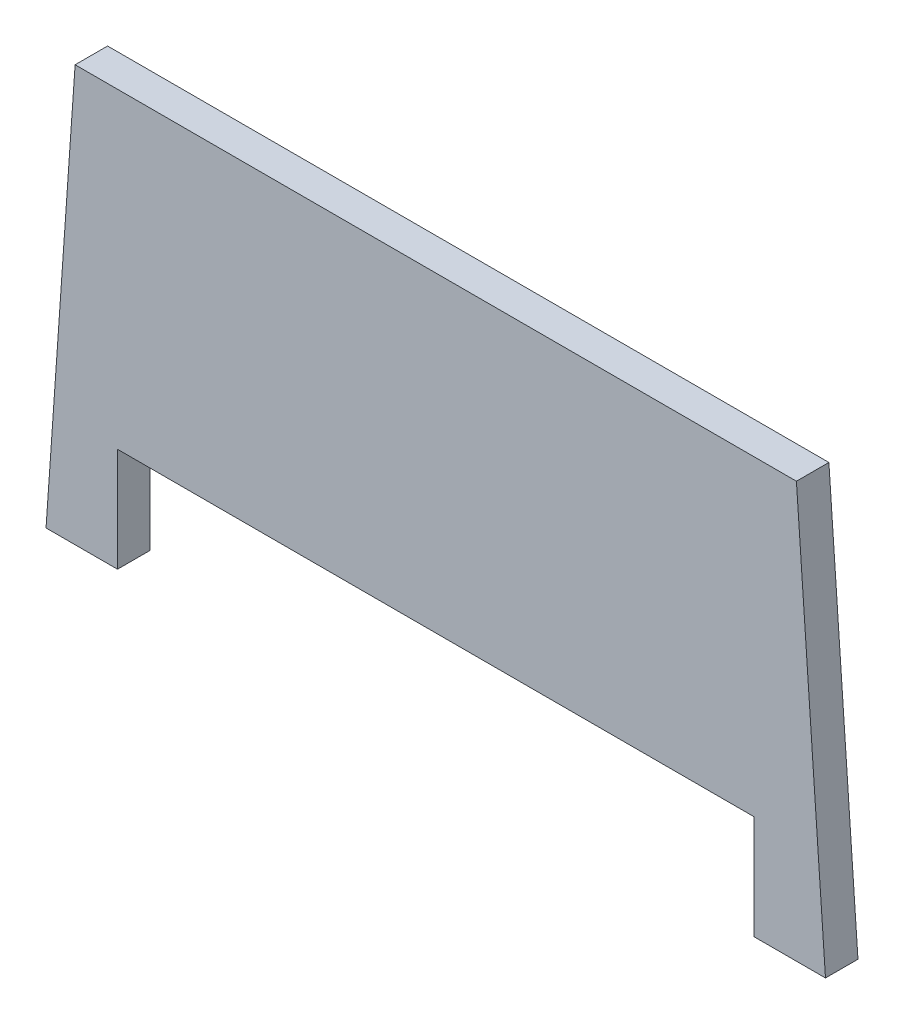
ISO-10303-21;
HEADER;
FILE_DESCRIPTION(('STEP AP214'),'2;1');
FILE_NAME('part.step','',(''),(''),'','','');
FILE_SCHEMA(('AUTOMOTIVE_DESIGN { 1 0 10303 214 1 1 1 1 }'));
ENDSEC;
DATA;
#1=APPLICATION_CONTEXT('core data for automotive mechanical design processes');
#2=APPLICATION_PROTOCOL_DEFINITION('international standard','automotive_design',2000,#1);
#3=PRODUCT_CONTEXT('',#1,'mechanical');
#4=PRODUCT('Part','Part','',(#3));
#5=PRODUCT_RELATED_PRODUCT_CATEGORY('part','',(#4));
#6=PRODUCT_DEFINITION_FORMATION('','',#4);
#7=PRODUCT_DEFINITION_CONTEXT('part definition',#1,'design');
#8=PRODUCT_DEFINITION('design','',#6,#7);
#9=PRODUCT_DEFINITION_SHAPE('','',#8);
#10=(LENGTH_UNIT() NAMED_UNIT(*) SI_UNIT(.MILLI.,.METRE.));
#11=(NAMED_UNIT(*) PLANE_ANGLE_UNIT() SI_UNIT($,.RADIAN.));
#12=(NAMED_UNIT(*) SI_UNIT($,.STERADIAN.) SOLID_ANGLE_UNIT());
#13=UNCERTAINTY_MEASURE_WITH_UNIT(LENGTH_MEASURE(1.E-05),#10,'distance_accuracy_value','');
#14=(GEOMETRIC_REPRESENTATION_CONTEXT(3) GLOBAL_UNCERTAINTY_ASSIGNED_CONTEXT((#13)) GLOBAL_UNIT_ASSIGNED_CONTEXT((#10,
#11,#12)) REPRESENTATION_CONTEXT('',''));
#15=CARTESIAN_POINT('',(0.,0.,0.));
#16=DIRECTION('',(0.,0.,1.));
#17=DIRECTION('',(1.,0.,0.));
#18=AXIS2_PLACEMENT_3D('',#15,#16,#17);
#19=CARTESIAN_POINT('',(627.623420178076,320.,25.));
#20=DIRECTION('',(0.,-1.,0.));
#21=DIRECTION('',(0.,0.,-1.));
#22=AXIS2_PLACEMENT_3D('',#19,#20,#21);
#23=PLANE('',#22);
#24=DIRECTION('',(-1.,0.,0.));
#25=VECTOR('',#24,1.);
#26=CARTESIAN_POINT('',(627.623420178076,320.,0.));
#27=LINE('',#26,#25);
#28=CARTESIAN_POINT('',(627.623420178076,320.,0.));
#29=VERTEX_POINT('',#28);
#30=CARTESIAN_POINT('',(72.3765798219226,320.,0.));
#31=VERTEX_POINT('',#30);
#32=EDGE_CURVE('E109',#29,#31,#27,.T.);
#33=ORIENTED_EDGE('',*,*,#32,.T.);
#34=DIRECTION('',(0.,0.,-1.));
#35=VECTOR('',#34,1.);
#36=CARTESIAN_POINT('',(72.3765798219226,320.,25.));
#37=LINE('',#36,#35);
#38=CARTESIAN_POINT('',(72.3765798219226,320.,25.));
#39=VERTEX_POINT('',#38);
#40=EDGE_CURVE('E11',#39,#31,#37,.T.);
#41=ORIENTED_EDGE('',*,*,#40,.F.);
#42=DIRECTION('',(-1.,0.,0.));
#43=VECTOR('',#42,1.);
#44=CARTESIAN_POINT('',(627.623420178076,320.,25.));
#45=LINE('',#44,#43);
#46=CARTESIAN_POINT('',(627.623420178076,320.,25.));
#47=VERTEX_POINT('',#46);
#48=EDGE_CURVE('E129',#47,#39,#45,.T.);
#49=ORIENTED_EDGE('',*,*,#48,.F.);
#50=DIRECTION('',(0.,0.,-1.));
#51=VECTOR('',#50,1.);
#52=CARTESIAN_POINT('',(627.623420178076,320.,25.));
#53=LINE('',#52,#51);
#54=EDGE_CURVE('E130',#47,#29,#53,.T.);
#55=ORIENTED_EDGE('',*,*,#54,.T.);
#56=EDGE_LOOP('',(#33,#41,#49,#55));
#57=FACE_BOUND('',#56,.T.);
#58=ADVANCED_FACE('F36',(#57),#23,.F.);
#59=CARTESIAN_POINT('',(50.,0.,25.));
#60=DIRECTION('',(-0.997564050259824,0.0697564737441229,0.));
#61=DIRECTION('',(-0.0697564737441229,-0.997564050259825,0.));
#62=AXIS2_PLACEMENT_3D('',#59,#60,#61);
#63=PLANE('',#62);
#64=DIRECTION('',(0.0697564737441229,0.997564050259824,0.));
#65=VECTOR('',#64,1.);
#66=CARTESIAN_POINT('',(50.,0.,0.));
#67=LINE('',#66,#65);
#68=CARTESIAN_POINT('',(50.,0.,0.));
#69=VERTEX_POINT('',#68);
#70=EDGE_CURVE('E119',#69,#31,#67,.T.);
#71=ORIENTED_EDGE('',*,*,#70,.F.);
#72=DIRECTION('',(0.,0.,-1.));
#73=VECTOR('',#72,1.);
#74=CARTESIAN_POINT('',(50.,0.,25.));
#75=LINE('',#74,#73);
#76=CARTESIAN_POINT('',(50.,0.,25.));
#77=VERTEX_POINT('',#76);
#78=EDGE_CURVE('E43',#77,#69,#75,.T.);
#79=ORIENTED_EDGE('',*,*,#78,.F.);
#80=DIRECTION('',(0.0697564737441229,0.997564050259824,0.));
#81=VECTOR('',#80,1.);
#82=CARTESIAN_POINT('',(50.,0.,25.));
#83=LINE('',#82,#81);
#84=EDGE_CURVE('E157',#77,#39,#83,.T.);
#85=ORIENTED_EDGE('',*,*,#84,.T.);
#86=ORIENTED_EDGE('',*,*,#40,.T.);
#87=EDGE_LOOP('',(#71,#79,#85,#86));
#88=FACE_BOUND('',#87,.T.);
#89=ADVANCED_FACE('F177',(#88),#63,.T.);
#90=CARTESIAN_POINT('',(50.,0.,25.));
#91=DIRECTION('',(0.,1.,0.));
#92=DIRECTION('',(0.,0.,1.));
#93=AXIS2_PLACEMENT_3D('',#90,#91,#92);
#94=PLANE('',#93);
#95=DIRECTION('',(1.,0.,0.));
#96=VECTOR('',#95,1.);
#97=CARTESIAN_POINT('',(50.,0.,0.));
#98=LINE('',#97,#96);
#99=CARTESIAN_POINT('',(104.999999999999,0.,0.));
#100=VERTEX_POINT('',#99);
#101=EDGE_CURVE('E115',#69,#100,#98,.T.);
#102=ORIENTED_EDGE('',*,*,#101,.T.);
#103=DIRECTION('',(0.,0.,1.));
#104=VECTOR('',#103,1.);
#105=CARTESIAN_POINT('',(104.999999999999,0.,0.));
#106=LINE('',#105,#104);
#107=CARTESIAN_POINT('',(104.999999999999,0.,25.));
#108=VERTEX_POINT('',#107);
#109=EDGE_CURVE('E99',#100,#108,#106,.T.);
#110=ORIENTED_EDGE('',*,*,#109,.T.);
#111=DIRECTION('',(1.,0.,0.));
#112=VECTOR('',#111,1.);
#113=CARTESIAN_POINT('',(50.,0.,25.));
#114=LINE('',#113,#112);
#115=EDGE_CURVE('E155',#77,#108,#114,.T.);
#116=ORIENTED_EDGE('',*,*,#115,.F.);
#117=ORIENTED_EDGE('',*,*,#78,.T.);
#118=EDGE_LOOP('',(#102,#110,#116,#117));
#119=FACE_BOUND('',#118,.T.);
#120=ADVANCED_FACE('F118',(#119),#94,.F.);
#121=CARTESIAN_POINT('',(184.999999999999,80.,25.));
#122=DIRECTION('',(0.,1.,0.));
#123=DIRECTION('',(0.,0.,1.));
#124=AXIS2_PLACEMENT_3D('',#121,#122,#123);
#125=PLANE('',#124);
#126=DIRECTION('',(1.,0.,0.));
#127=VECTOR('',#126,1.);
#128=CARTESIAN_POINT('',(184.999999999999,80.,0.));
#129=LINE('',#128,#127);
#130=CARTESIAN_POINT('',(104.999999999999,80.,0.));
#131=VERTEX_POINT('',#130);
#132=CARTESIAN_POINT('',(594.999999999999,80.,0.));
#133=VERTEX_POINT('',#132);
#134=EDGE_CURVE('E50',#131,#133,#129,.T.);
#135=ORIENTED_EDGE('',*,*,#134,.T.);
#136=DIRECTION('',(0.,0.,1.));
#137=VECTOR('',#136,1.);
#138=CARTESIAN_POINT('',(594.999999999999,80.,0.));
#139=LINE('',#138,#137);
#140=CARTESIAN_POINT('',(594.999999999999,80.,25.));
#141=VERTEX_POINT('',#140);
#142=EDGE_CURVE('E163',#133,#141,#139,.T.);
#143=ORIENTED_EDGE('',*,*,#142,.T.);
#144=DIRECTION('',(1.,0.,0.));
#145=VECTOR('',#144,1.);
#146=CARTESIAN_POINT('',(184.999999999999,80.,25.));
#147=LINE('',#146,#145);
#148=CARTESIAN_POINT('',(104.999999999999,80.,25.));
#149=VERTEX_POINT('',#148);
#150=EDGE_CURVE('E153',#149,#141,#147,.T.);
#151=ORIENTED_EDGE('',*,*,#150,.F.);
#152=DIRECTION('',(0.,0.,1.));
#153=VECTOR('',#152,1.);
#154=CARTESIAN_POINT('',(104.999999999999,80.,0.));
#155=LINE('',#154,#153);
#156=EDGE_CURVE('E110',#131,#149,#155,.T.);
#157=ORIENTED_EDGE('',*,*,#156,.F.);
#158=EDGE_LOOP('',(#135,#143,#151,#157));
#159=FACE_BOUND('',#158,.T.);
#160=ADVANCED_FACE('F185',(#159),#125,.F.);
#161=CARTESIAN_POINT('',(514.999999999999,1.66533453693773E-13,25.));
#162=DIRECTION('',(0.,1.,0.));
#163=DIRECTION('',(-1.,0.,0.));
#164=AXIS2_PLACEMENT_3D('',#161,#162,#163);
#165=PLANE('',#164);
#166=DIRECTION('',(1.,0.,0.));
#167=VECTOR('',#166,1.);
#168=CARTESIAN_POINT('',(514.999999999999,1.66533453693773E-13,25.));
#169=LINE('',#168,#167);
#170=CARTESIAN_POINT('',(595.,1.66533453693773E-13,25.));
#171=VERTEX_POINT('',#170);
#172=CARTESIAN_POINT('',(650.,1.17145536458252E-13,25.));
#173=VERTEX_POINT('',#172);
#174=EDGE_CURVE('E151',#171,#173,#169,.T.);
#175=ORIENTED_EDGE('',*,*,#174,.F.);
#176=DIRECTION('',(0.,0.,1.));
#177=VECTOR('',#176,1.);
#178=CARTESIAN_POINT('',(595.,1.66533453693773E-13,0.));
#179=LINE('',#178,#177);
#180=CARTESIAN_POINT('',(595.,1.66533453693773E-13,0.));
#181=VERTEX_POINT('',#180);
#182=EDGE_CURVE('E161',#181,#171,#179,.T.);
#183=ORIENTED_EDGE('',*,*,#182,.F.);
#184=DIRECTION('',(1.,0.,0.));
#185=VECTOR('',#184,1.);
#186=CARTESIAN_POINT('',(514.999999999999,1.66533453693773E-13,0.));
#187=LINE('',#186,#185);
#188=CARTESIAN_POINT('',(650.,1.17145536458252E-13,0.));
#189=VERTEX_POINT('',#188);
#190=EDGE_CURVE('E121',#181,#189,#187,.T.);
#191=ORIENTED_EDGE('',*,*,#190,.T.);
#192=DIRECTION('',(0.,0.,-1.));
#193=VECTOR('',#192,1.);
#194=CARTESIAN_POINT('',(650.,1.17145536458252E-13,25.));
#195=LINE('',#194,#193);
#196=EDGE_CURVE('E133',#173,#189,#195,.T.);
#197=ORIENTED_EDGE('',*,*,#196,.F.);
#198=EDGE_LOOP('',(#175,#183,#191,#197));
#199=FACE_BOUND('',#198,.T.);
#200=ADVANCED_FACE('F190',(#199),#165,.F.);
#201=CARTESIAN_POINT('',(650.,1.17145536458252E-13,25.));
#202=DIRECTION('',(-0.997564050259824,-0.0697564737441267,0.));
#203=DIRECTION('',(0.0697564737441267,-0.997564050259824,0.));
#204=AXIS2_PLACEMENT_3D('',#201,#202,#203);
#205=PLANE('',#204);
#206=DIRECTION('',(-0.0697564737441266,0.997564050259824,0.));
#207=VECTOR('',#206,1.);
#208=CARTESIAN_POINT('',(650.,1.17145536458252E-13,0.));
#209=LINE('',#208,#207);
#210=EDGE_CURVE('E127',#189,#29,#209,.T.);
#211=ORIENTED_EDGE('',*,*,#210,.T.);
#212=ORIENTED_EDGE('',*,*,#54,.F.);
#213=DIRECTION('',(-0.0697564737441266,0.997564050259824,0.));
#214=VECTOR('',#213,1.);
#215=CARTESIAN_POINT('',(650.,1.17145536458252E-13,25.));
#216=LINE('',#215,#214);
#217=EDGE_CURVE('E134',#173,#47,#216,.T.);
#218=ORIENTED_EDGE('',*,*,#217,.F.);
#219=ORIENTED_EDGE('',*,*,#196,.T.);
#220=EDGE_LOOP('',(#211,#212,#218,#219));
#221=FACE_BOUND('',#220,.T.);
#222=ADVANCED_FACE('F140',(#221),#205,.F.);
#223=CARTESIAN_POINT('',(0.,0.,25.));
#224=DIRECTION('',(0.,0.,-1.));
#225=DIRECTION('',(-1.,0.,0.));
#226=AXIS2_PLACEMENT_3D('',#223,#224,#225);
#227=PLANE('',#226);
#228=ORIENTED_EDGE('',*,*,#115,.T.);
#229=DIRECTION('',(0.,-1.,0.));
#230=VECTOR('',#229,1.);
#231=CARTESIAN_POINT('',(104.999999999999,80.,25.));
#232=LINE('',#231,#230);
#233=EDGE_CURVE('E104',#149,#108,#232,.T.);
#234=ORIENTED_EDGE('',*,*,#233,.F.);
#235=ORIENTED_EDGE('',*,*,#150,.T.);
#236=DIRECTION('',(0.,1.,0.));
#237=VECTOR('',#236,1.);
#238=CARTESIAN_POINT('',(594.999999999999,80.,25.));
#239=LINE('',#238,#237);
#240=EDGE_CURVE('E166',#171,#141,#239,.T.);
#241=ORIENTED_EDGE('',*,*,#240,.F.);
#242=ORIENTED_EDGE('',*,*,#174,.T.);
#243=ORIENTED_EDGE('',*,*,#217,.T.);
#244=ORIENTED_EDGE('',*,*,#48,.T.);
#245=ORIENTED_EDGE('',*,*,#84,.F.);
#246=EDGE_LOOP('',(#228,#234,#235,#241,#242,#243,#244,#245));
#247=FACE_BOUND('',#246,.T.);
#248=ADVANCED_FACE('F172',(#247),#227,.F.);
#249=CARTESIAN_POINT('',(0.,0.,0.));
#250=DIRECTION('',(0.,0.,-1.));
#251=DIRECTION('',(-1.,0.,0.));
#252=AXIS2_PLACEMENT_3D('',#249,#250,#251);
#253=PLANE('',#252);
#254=DIRECTION('',(0.,-1.,0.));
#255=VECTOR('',#254,1.);
#256=CARTESIAN_POINT('',(104.999999999999,80.,0.));
#257=LINE('',#256,#255);
#258=EDGE_CURVE('E102',#131,#100,#257,.T.);
#259=ORIENTED_EDGE('',*,*,#258,.T.);
#260=ORIENTED_EDGE('',*,*,#101,.F.);
#261=ORIENTED_EDGE('',*,*,#70,.T.);
#262=ORIENTED_EDGE('',*,*,#32,.F.);
#263=ORIENTED_EDGE('',*,*,#210,.F.);
#264=ORIENTED_EDGE('',*,*,#190,.F.);
#265=DIRECTION('',(0.,1.,0.));
#266=VECTOR('',#265,1.);
#267=CARTESIAN_POINT('',(594.999999999999,80.,0.));
#268=LINE('',#267,#266);
#269=EDGE_CURVE('E164',#181,#133,#268,.T.);
#270=ORIENTED_EDGE('',*,*,#269,.T.);
#271=ORIENTED_EDGE('',*,*,#134,.F.);
#272=EDGE_LOOP('',(#259,#260,#261,#262,#263,#264,#270,#271));
#273=FACE_BOUND('',#272,.T.);
#274=ADVANCED_FACE('F113',(#273),#253,.T.);
#275=CARTESIAN_POINT('',(594.999999999999,80.,0.));
#276=DIRECTION('',(1.,0.,0.));
#277=DIRECTION('',(0.,1.,0.));
#278=AXIS2_PLACEMENT_3D('',#275,#276,#277);
#279=PLANE('',#278);
#280=ORIENTED_EDGE('',*,*,#240,.T.);
#281=ORIENTED_EDGE('',*,*,#142,.F.);
#282=ORIENTED_EDGE('',*,*,#269,.F.);
#283=ORIENTED_EDGE('',*,*,#182,.T.);
#284=EDGE_LOOP('',(#280,#281,#282,#283));
#285=FACE_BOUND('',#284,.T.);
#286=ADVANCED_FACE('F197',(#285),#279,.F.);
#287=CARTESIAN_POINT('',(104.999999999999,80.,0.));
#288=DIRECTION('',(-1.,0.,0.));
#289=DIRECTION('',(0.,0.,1.));
#290=AXIS2_PLACEMENT_3D('',#287,#288,#289);
#291=PLANE('',#290);
#292=ORIENTED_EDGE('',*,*,#233,.T.);
#293=ORIENTED_EDGE('',*,*,#109,.F.);
#294=ORIENTED_EDGE('',*,*,#258,.F.);
#295=ORIENTED_EDGE('',*,*,#156,.T.);
#296=EDGE_LOOP('',(#292,#293,#294,#295));
#297=FACE_BOUND('',#296,.T.);
#298=ADVANCED_FACE('F100',(#297),#291,.F.);
#299=CLOSED_SHELL('',(#58,#89,#120,#160,#200,#222,#248,#274,#286,#298));
#300=MANIFOLD_SOLID_BREP('B2',#299);
#301=ADVANCED_BREP_SHAPE_REPRESENTATION('',(#18,#300),#14);
#302=SHAPE_DEFINITION_REPRESENTATION(#9,#301);
ENDSEC;
END-ISO-10303-21;
